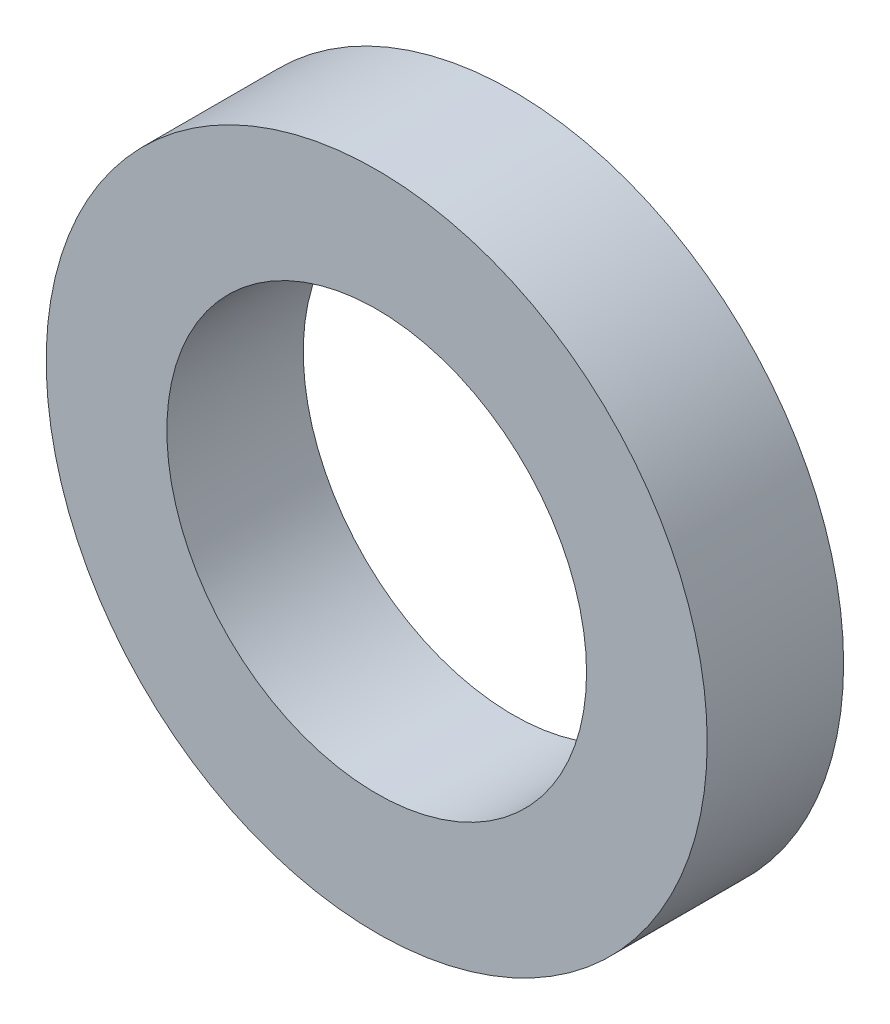
ISO-10303-21;
HEADER;
FILE_DESCRIPTION(('STEP AP214'),'2;1');
FILE_NAME('part.step','',(''),(''),'','','');
FILE_SCHEMA(('AUTOMOTIVE_DESIGN { 1 0 10303 214 1 1 1 1 }'));
ENDSEC;
DATA;
#1=APPLICATION_CONTEXT('core data for automotive mechanical design processes');
#2=APPLICATION_PROTOCOL_DEFINITION('international standard','automotive_design',2000,#1);
#3=PRODUCT_CONTEXT('',#1,'mechanical');
#4=PRODUCT('Part','Part','',(#3));
#5=PRODUCT_RELATED_PRODUCT_CATEGORY('part','',(#4));
#6=PRODUCT_DEFINITION_FORMATION('','',#4);
#7=PRODUCT_DEFINITION_CONTEXT('part definition',#1,'design');
#8=PRODUCT_DEFINITION('design','',#6,#7);
#9=PRODUCT_DEFINITION_SHAPE('','',#8);
#10=(LENGTH_UNIT() NAMED_UNIT(*) SI_UNIT(.MILLI.,.METRE.));
#11=(NAMED_UNIT(*) PLANE_ANGLE_UNIT() SI_UNIT($,.RADIAN.));
#12=(NAMED_UNIT(*) SI_UNIT($,.STERADIAN.) SOLID_ANGLE_UNIT());
#13=UNCERTAINTY_MEASURE_WITH_UNIT(LENGTH_MEASURE(1.E-05),#10,'distance_accuracy_value','');
#14=(GEOMETRIC_REPRESENTATION_CONTEXT(3) GLOBAL_UNCERTAINTY_ASSIGNED_CONTEXT((#13)) GLOBAL_UNIT_ASSIGNED_CONTEXT((#10,
#11,#12)) REPRESENTATION_CONTEXT('',''));
#15=CARTESIAN_POINT('',(0.,0.,0.));
#16=DIRECTION('',(0.,0.,1.));
#17=DIRECTION('',(1.,0.,0.));
#18=AXIS2_PLACEMENT_3D('',#15,#16,#17);
#19=CARTESIAN_POINT('',(0.,0.,5.2));
#20=DIRECTION('',(0.,0.,1.));
#21=DIRECTION('',(1.,0.,0.));
#22=AXIS2_PLACEMENT_3D('',#19,#20,#21);
#23=PLANE('',#22);
#24=CARTESIAN_POINT('',(0.,0.,5.2));
#25=DIRECTION('',(0.,0.,1.));
#26=DIRECTION('',(1.,0.,0.));
#27=AXIS2_PLACEMENT_3D('',#24,#25,#26);
#28=CIRCLE('',#27,12.6);
#29=CARTESIAN_POINT('',(12.6,0.,5.2));
#30=VERTEX_POINT('',#29);
#31=EDGE_CURVE('E10',#30,#30,#28,.T.);
#32=ORIENTED_EDGE('',*,*,#31,.T.);
#33=EDGE_LOOP('',(#32));
#34=FACE_BOUND('',#33,.T.);
#35=CARTESIAN_POINT('',(0.,0.,5.2));
#36=DIRECTION('',(0.,0.,1.));
#37=DIRECTION('',(1.,0.,0.));
#38=AXIS2_PLACEMENT_3D('',#35,#36,#37);
#39=CIRCLE('',#38,8.);
#40=CARTESIAN_POINT('',(8.,0.,5.2));
#41=VERTEX_POINT('',#40);
#42=EDGE_CURVE('E42',#41,#41,#39,.T.);
#43=ORIENTED_EDGE('',*,*,#42,.F.);
#44=EDGE_LOOP('',(#43));
#45=FACE_BOUND('',#44,.T.);
#46=ADVANCED_FACE('F31',(#34,#45),#23,.T.);
#47=CARTESIAN_POINT('',(0.,0.,0.));
#48=DIRECTION('',(0.,0.,1.));
#49=DIRECTION('',(1.,0.,0.));
#50=AXIS2_PLACEMENT_3D('',#47,#48,#49);
#51=PLANE('',#50);
#52=CARTESIAN_POINT('',(0.,0.,0.));
#53=DIRECTION('',(0.,0.,1.));
#54=DIRECTION('',(1.,0.,0.));
#55=AXIS2_PLACEMENT_3D('',#52,#53,#54);
#56=CIRCLE('',#55,12.6);
#57=CARTESIAN_POINT('',(12.6,0.,0.));
#58=VERTEX_POINT('',#57);
#59=EDGE_CURVE('E35',#58,#58,#56,.T.);
#60=ORIENTED_EDGE('',*,*,#59,.F.);
#61=EDGE_LOOP('',(#60));
#62=FACE_BOUND('',#61,.T.);
#63=CARTESIAN_POINT('',(0.,0.,0.));
#64=DIRECTION('',(0.,0.,1.));
#65=DIRECTION('',(1.,0.,0.));
#66=AXIS2_PLACEMENT_3D('',#63,#64,#65);
#67=CIRCLE('',#66,8.);
#68=CARTESIAN_POINT('',(8.,0.,0.));
#69=VERTEX_POINT('',#68);
#70=EDGE_CURVE('E44',#69,#69,#67,.T.);
#71=ORIENTED_EDGE('',*,*,#70,.T.);
#72=EDGE_LOOP('',(#71));
#73=FACE_BOUND('',#72,.T.);
#74=ADVANCED_FACE('F54',(#62,#73),#51,.F.);
#75=CARTESIAN_POINT('',(0.,0.,5.2));
#76=DIRECTION('',(0.,0.,-1.));
#77=DIRECTION('',(-1.,0.,0.));
#78=AXIS2_PLACEMENT_3D('',#75,#76,#77);
#79=CYLINDRICAL_SURFACE('',#78,12.6);
#80=ORIENTED_EDGE('',*,*,#31,.F.);
#81=EDGE_LOOP('',(#80));
#82=FACE_BOUND('',#81,.T.);
#83=ORIENTED_EDGE('',*,*,#59,.T.);
#84=EDGE_LOOP('',(#83));
#85=FACE_BOUND('',#84,.T.);
#86=ADVANCED_FACE('F33',(#82,#85),#79,.T.);
#87=CARTESIAN_POINT('',(0.,0.,5.2));
#88=DIRECTION('',(0.,0.,-1.));
#89=DIRECTION('',(-1.,0.,0.));
#90=AXIS2_PLACEMENT_3D('',#87,#88,#89);
#91=CYLINDRICAL_SURFACE('',#90,8.);
#92=ORIENTED_EDGE('',*,*,#42,.T.);
#93=EDGE_LOOP('',(#92));
#94=FACE_BOUND('',#93,.T.);
#95=ORIENTED_EDGE('',*,*,#70,.F.);
#96=EDGE_LOOP('',(#95));
#97=FACE_BOUND('',#96,.T.);
#98=ADVANCED_FACE('F50',(#94,#97),#91,.F.);
#99=CLOSED_SHELL('',(#46,#74,#86,#98));
#100=MANIFOLD_SOLID_BREP('B2',#99);
#101=ADVANCED_BREP_SHAPE_REPRESENTATION('',(#18,#100),#14);
#102=SHAPE_DEFINITION_REPRESENTATION(#9,#101);
ENDSEC;
END-ISO-10303-21;
